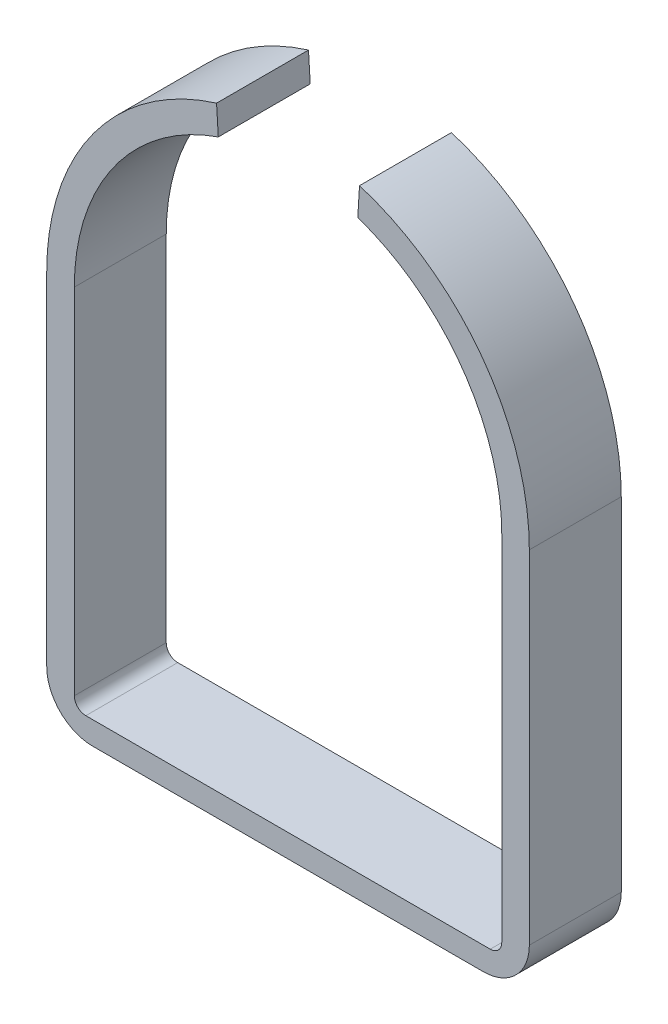
ISO-10303-21;
HEADER;
FILE_DESCRIPTION(('STEP AP214'),'2;1');
FILE_NAME('part.step','',(''),(''),'','','');
FILE_SCHEMA(('AUTOMOTIVE_DESIGN { 1 0 10303 214 1 1 1 1 }'));
ENDSEC;
DATA;
#1=APPLICATION_CONTEXT('core data for automotive mechanical design processes');
#2=APPLICATION_PROTOCOL_DEFINITION('international standard','automotive_design',2000,#1);
#3=PRODUCT_CONTEXT('',#1,'mechanical');
#4=PRODUCT('Part','Part','',(#3));
#5=PRODUCT_RELATED_PRODUCT_CATEGORY('part','',(#4));
#6=PRODUCT_DEFINITION_FORMATION('','',#4);
#7=PRODUCT_DEFINITION_CONTEXT('part definition',#1,'design');
#8=PRODUCT_DEFINITION('design','',#6,#7);
#9=PRODUCT_DEFINITION_SHAPE('','',#8);
#10=(LENGTH_UNIT() NAMED_UNIT(*) SI_UNIT(.MILLI.,.METRE.));
#11=(NAMED_UNIT(*) PLANE_ANGLE_UNIT() SI_UNIT($,.RADIAN.));
#12=(NAMED_UNIT(*) SI_UNIT($,.STERADIAN.) SOLID_ANGLE_UNIT());
#13=UNCERTAINTY_MEASURE_WITH_UNIT(LENGTH_MEASURE(1.E-05),#10,'distance_accuracy_value','');
#14=(GEOMETRIC_REPRESENTATION_CONTEXT(3) GLOBAL_UNCERTAINTY_ASSIGNED_CONTEXT((#13)) GLOBAL_UNIT_ASSIGNED_CONTEXT((#10,
#11,#12)) REPRESENTATION_CONTEXT('',''));
#15=CARTESIAN_POINT('',(0.,0.,0.));
#16=DIRECTION('',(0.,0.,1.));
#17=DIRECTION('',(1.,0.,0.));
#18=AXIS2_PLACEMENT_3D('',#15,#16,#17);
#19=CARTESIAN_POINT('',(0.,0.,56.8469714478884));
#20=DIRECTION('',(0.,0.,-1.));
#21=DIRECTION('',(-1.,0.,0.));
#22=AXIS2_PLACEMENT_3D('',#19,#20,#21);
#23=CYLINDRICAL_SURFACE('',#22,9.3);
#24=DIRECTION('',(0.,0.,-1.));
#25=VECTOR('',#24,1.);
#26=CARTESIAN_POINT('',(3.03467311666204,8.79094756411439,56.8469714478884));
#27=LINE('',#26,#25);
#28=CARTESIAN_POINT('',(3.03467311666204,8.79094756411439,1.5));
#29=VERTEX_POINT('',#28);
#30=CARTESIAN_POINT('',(3.03467311666204,8.79094756411439,5.5));
#31=VERTEX_POINT('',#30);
#32=EDGE_CURVE('E238',#29,#31,#27,.F.);
#33=ORIENTED_EDGE('',*,*,#32,.F.);
#34=CARTESIAN_POINT('',(0.,0.,1.5));
#35=DIRECTION('',(0.,0.,1.));
#36=DIRECTION('',(-1.,0.,0.));
#37=AXIS2_PLACEMENT_3D('',#34,#35,#36);
#38=CIRCLE('',#37,9.3);
#39=CARTESIAN_POINT('',(9.3,0.,1.5));
#40=VERTEX_POINT('',#39);
#41=EDGE_CURVE('E220',#40,#29,#38,.T.);
#42=ORIENTED_EDGE('',*,*,#41,.F.);
#43=DIRECTION('',(0.,0.,-1.));
#44=VECTOR('',#43,1.);
#45=CARTESIAN_POINT('',(9.3,0.,56.8469714478884));
#46=LINE('',#45,#44);
#47=CARTESIAN_POINT('',(9.3,0.,5.5));
#48=VERTEX_POINT('',#47);
#49=EDGE_CURVE('E307',#48,#40,#46,.T.);
#50=ORIENTED_EDGE('',*,*,#49,.F.);
#51=CARTESIAN_POINT('',(0.,0.,5.5));
#52=DIRECTION('',(0.,0.,1.));
#53=DIRECTION('',(1.,0.,0.));
#54=AXIS2_PLACEMENT_3D('',#51,#52,#53);
#55=CIRCLE('',#54,9.3);
#56=EDGE_CURVE('E255',#48,#31,#55,.T.);
#57=ORIENTED_EDGE('',*,*,#56,.T.);
#58=EDGE_LOOP('',(#33,#42,#50,#57));
#59=FACE_BOUND('',#58,.T.);
#60=ADVANCED_FACE('F48',(#59),#23,.F.);
#61=CARTESIAN_POINT('',(0.,0.,5.5));
#62=DIRECTION('',(0.,0.,1.));
#63=DIRECTION('',(1.,0.,0.));
#64=AXIS2_PLACEMENT_3D('',#61,#62,#63);
#65=PLANE('',#64);
#66=DIRECTION('',(0.,-1.,0.));
#67=VECTOR('',#66,1.);
#68=CARTESIAN_POINT('',(-10.5,0.,5.5));
#69=LINE('',#68,#67);
#70=CARTESIAN_POINT('',(-10.5,0.,5.5));
#71=VERTEX_POINT('',#70);
#72=CARTESIAN_POINT('',(-10.5,-14.900343897342,5.5));
#73=VERTEX_POINT('',#72);
#74=EDGE_CURVE('E180',#71,#73,#69,.T.);
#75=ORIENTED_EDGE('',*,*,#74,.T.);
#76=CARTESIAN_POINT('',(-8.5,-14.900343897342,5.5));
#77=DIRECTION('',(0.,0.,1.));
#78=DIRECTION('',(1.,0.,0.));
#79=AXIS2_PLACEMENT_3D('',#76,#77,#78);
#80=CIRCLE('',#79,2.);
#81=CARTESIAN_POINT('',(-8.5,-16.900343897342,5.5));
#82=VERTEX_POINT('',#81);
#83=EDGE_CURVE('E319',#73,#82,#80,.T.);
#84=ORIENTED_EDGE('',*,*,#83,.T.);
#85=DIRECTION('',(-1.,0.,0.));
#86=VECTOR('',#85,1.);
#87=CARTESIAN_POINT('',(-11.1726993556512,-16.900343897342,5.5));
#88=LINE('',#87,#86);
#89=CARTESIAN_POINT('',(8.5,-16.900343897342,5.5));
#90=VERTEX_POINT('',#89);
#91=EDGE_CURVE('E174',#90,#82,#88,.T.);
#92=ORIENTED_EDGE('',*,*,#91,.F.);
#93=CARTESIAN_POINT('',(8.5,-14.900343897342,5.5));
#94=DIRECTION('',(0.,0.,1.));
#95=DIRECTION('',(1.,0.,0.));
#96=AXIS2_PLACEMENT_3D('',#93,#94,#95);
#97=CIRCLE('',#96,2.);
#98=CARTESIAN_POINT('',(10.5,-14.900343897342,5.5));
#99=VERTEX_POINT('',#98);
#100=EDGE_CURVE('E316',#90,#99,#97,.T.);
#101=ORIENTED_EDGE('',*,*,#100,.T.);
#102=DIRECTION('',(0.,-1.,0.));
#103=VECTOR('',#102,1.);
#104=CARTESIAN_POINT('',(10.5,0.,5.5));
#105=LINE('',#104,#103);
#106=CARTESIAN_POINT('',(10.5,0.,5.5));
#107=VERTEX_POINT('',#106);
#108=EDGE_CURVE('E260',#107,#99,#105,.T.);
#109=ORIENTED_EDGE('',*,*,#108,.F.);
#110=CARTESIAN_POINT('',(0.,0.,5.5));
#111=DIRECTION('',(0.,0.,1.));
#112=DIRECTION('',(1.,0.,0.));
#113=AXIS2_PLACEMENT_3D('',#110,#111,#112);
#114=CIRCLE('',#113,10.5);
#115=CARTESIAN_POINT('',(3.11032664956738,10.0287520725657,5.5));
#116=VERTEX_POINT('',#115);
#117=EDGE_CURVE('E263',#116,#107,#114,.F.);
#118=ORIENTED_EDGE('',*,*,#117,.F.);
#119=DIRECTION('',(-0.0610052906976046,-0.998137442693591,0.));
#120=VECTOR('',#119,1.);
#121=CARTESIAN_POINT('',(2.48808370636675,-0.15206950796001,5.5));
#122=LINE('',#121,#120);
#123=EDGE_CURVE('E270',#116,#31,#122,.T.);
#124=ORIENTED_EDGE('',*,*,#123,.T.);
#125=ORIENTED_EDGE('',*,*,#56,.F.);
#126=DIRECTION('',(0.,1.,0.));
#127=VECTOR('',#126,1.);
#128=CARTESIAN_POINT('',(9.3,0.,5.5));
#129=LINE('',#128,#127);
#130=CARTESIAN_POINT('',(9.3,-15.4,5.5));
#131=VERTEX_POINT('',#130);
#132=EDGE_CURVE('E252',#131,#48,#129,.T.);
#133=ORIENTED_EDGE('',*,*,#132,.F.);
#134=CARTESIAN_POINT('',(8.8,-15.4,5.5));
#135=DIRECTION('',(0.,0.,1.));
#136=DIRECTION('',(1.,0.,0.));
#137=AXIS2_PLACEMENT_3D('',#134,#135,#136);
#138=CIRCLE('',#137,0.5);
#139=CARTESIAN_POINT('',(8.8,-15.9,5.5));
#140=VERTEX_POINT('',#139);
#141=EDGE_CURVE('E279',#131,#140,#138,.F.);
#142=ORIENTED_EDGE('',*,*,#141,.T.);
#143=DIRECTION('',(1.,0.,0.));
#144=VECTOR('',#143,1.);
#145=CARTESIAN_POINT('',(0.,-15.9,5.5));
#146=LINE('',#145,#144);
#147=CARTESIAN_POINT('',(-8.8,-15.9,5.5));
#148=VERTEX_POINT('',#147);
#149=EDGE_CURVE('E248',#148,#140,#146,.T.);
#150=ORIENTED_EDGE('',*,*,#149,.F.);
#151=CARTESIAN_POINT('',(-8.8,-15.4,5.5));
#152=DIRECTION('',(0.,0.,1.));
#153=DIRECTION('',(1.,0.,0.));
#154=AXIS2_PLACEMENT_3D('',#151,#152,#153);
#155=CIRCLE('',#154,0.5);
#156=CARTESIAN_POINT('',(-9.3,-15.4,5.5));
#157=VERTEX_POINT('',#156);
#158=EDGE_CURVE('E242',#148,#157,#155,.F.);
#159=ORIENTED_EDGE('',*,*,#158,.T.);
#160=DIRECTION('',(0.,-1.,0.));
#161=VECTOR('',#160,1.);
#162=CARTESIAN_POINT('',(-9.3,-15.9,5.5));
#163=LINE('',#162,#161);
#164=CARTESIAN_POINT('',(-9.3,0.,5.5));
#165=VERTEX_POINT('',#164);
#166=EDGE_CURVE('E243',#165,#157,#163,.T.);
#167=ORIENTED_EDGE('',*,*,#166,.F.);
#168=CARTESIAN_POINT('',(-3.03467311644218,8.79094756419029,5.5));
#169=VERTEX_POINT('',#168);
#170=EDGE_CURVE('E259',#169,#165,#55,.T.);
#171=ORIENTED_EDGE('',*,*,#170,.F.);
#172=DIRECTION('',(-0.0610052909139107,0.99813744268037,0.));
#173=VECTOR('',#172,1.);
#174=CARTESIAN_POINT('',(-2.48808370417207,-0.152069508367079,5.5));
#175=LINE('',#174,#173);
#176=CARTESIAN_POINT('',(-3.11032664961128,10.0287520725521,5.5));
#177=VERTEX_POINT('',#176);
#178=EDGE_CURVE('E273',#169,#177,#175,.T.);
#179=ORIENTED_EDGE('',*,*,#178,.T.);
#180=CARTESIAN_POINT('',(0.,0.,5.5));
#181=DIRECTION('',(0.,0.,1.));
#182=DIRECTION('',(1.,0.,0.));
#183=AXIS2_PLACEMENT_3D('',#180,#181,#182);
#184=CIRCLE('',#183,10.5);
#185=EDGE_CURVE('E267',#71,#177,#184,.F.);
#186=ORIENTED_EDGE('',*,*,#185,.F.);
#187=EDGE_LOOP('',(#75,#84,#92,#101,#109,#118,#124,#125,#133,#142,#150,#159,#167,#171,#179,#186));
#188=FACE_BOUND('',#187,.T.);
#189=ADVANCED_FACE('F340',(#188),#65,.T.);
#190=DIRECTION('',(0.,0.,-1.));
#191=VECTOR('',#190,1.);
#192=CARTESIAN_POINT('',(-3.03467311644218,8.79094756419029,56.8469714478884));
#193=LINE('',#192,#191);
#194=CARTESIAN_POINT('',(-3.03467311644218,8.79094756419029,1.5));
#195=VERTEX_POINT('',#194);
#196=EDGE_CURVE('E235',#169,#195,#193,.T.);
#197=ORIENTED_EDGE('',*,*,#196,.F.);
#198=ORIENTED_EDGE('',*,*,#170,.T.);
#199=DIRECTION('',(0.,0.,-1.));
#200=VECTOR('',#199,1.);
#201=CARTESIAN_POINT('',(-9.3,0.,56.8469714478884));
#202=LINE('',#201,#200);
#203=CARTESIAN_POINT('',(-9.3,0.,1.5));
#204=VERTEX_POINT('',#203);
#205=EDGE_CURVE('E185',#165,#204,#202,.T.);
#206=ORIENTED_EDGE('',*,*,#205,.T.);
#207=CARTESIAN_POINT('',(0.,0.,1.5));
#208=DIRECTION('',(0.,0.,1.));
#209=DIRECTION('',(-1.,0.,0.));
#210=AXIS2_PLACEMENT_3D('',#207,#208,#209);
#211=CIRCLE('',#210,9.3);
#212=EDGE_CURVE('E193',#195,#204,#211,.T.);
#213=ORIENTED_EDGE('',*,*,#212,.F.);
#214=EDGE_LOOP('',(#197,#198,#206,#213));
#215=FACE_BOUND('',#214,.T.);
#216=ADVANCED_FACE('F336',(#215),#23,.F.);
#217=CARTESIAN_POINT('',(-9.3,-15.9,56.8469714478884));
#218=DIRECTION('',(1.,0.,0.));
#219=DIRECTION('',(0.,0.,-1.));
#220=AXIS2_PLACEMENT_3D('',#217,#218,#219);
#221=PLANE('',#220);
#222=DIRECTION('',(0.,0.,-1.));
#223=VECTOR('',#222,1.);
#224=CARTESIAN_POINT('',(-9.3,-15.4,0.));
#225=LINE('',#224,#223);
#226=CARTESIAN_POINT('',(-9.3,-15.4,1.5));
#227=VERTEX_POINT('',#226);
#228=EDGE_CURVE('E247',#157,#227,#225,.T.);
#229=ORIENTED_EDGE('',*,*,#228,.T.);
#230=DIRECTION('',(0.,-1.,0.));
#231=VECTOR('',#230,1.);
#232=CARTESIAN_POINT('',(-9.3,0.,1.5));
#233=LINE('',#232,#231);
#234=EDGE_CURVE('E200',#204,#227,#233,.T.);
#235=ORIENTED_EDGE('',*,*,#234,.F.);
#236=ORIENTED_EDGE('',*,*,#205,.F.);
#237=ORIENTED_EDGE('',*,*,#166,.T.);
#238=EDGE_LOOP('',(#229,#235,#236,#237));
#239=FACE_BOUND('',#238,.T.);
#240=ADVANCED_FACE('F345',(#239),#221,.T.);
#241=CARTESIAN_POINT('',(0.,-15.9,56.8469714478884));
#242=DIRECTION('',(0.,1.,0.));
#243=DIRECTION('',(0.,0.,1.));
#244=AXIS2_PLACEMENT_3D('',#241,#242,#243);
#245=PLANE('',#244);
#246=DIRECTION('',(0.,0.,-1.));
#247=VECTOR('',#246,1.);
#248=CARTESIAN_POINT('',(8.8,-15.9,0.));
#249=LINE('',#248,#247);
#250=CARTESIAN_POINT('',(8.8,-15.9,1.5));
#251=VERTEX_POINT('',#250);
#252=EDGE_CURVE('E291',#140,#251,#249,.T.);
#253=ORIENTED_EDGE('',*,*,#252,.T.);
#254=DIRECTION('',(1.,0.,0.));
#255=VECTOR('',#254,1.);
#256=CARTESIAN_POINT('',(-8.8,-15.9,1.5));
#257=LINE('',#256,#255);
#258=CARTESIAN_POINT('',(-8.8,-15.9,1.5));
#259=VERTEX_POINT('',#258);
#260=EDGE_CURVE('E208',#259,#251,#257,.T.);
#261=ORIENTED_EDGE('',*,*,#260,.F.);
#262=DIRECTION('',(0.,0.,-1.));
#263=VECTOR('',#262,1.);
#264=CARTESIAN_POINT('',(-8.8,-15.9,6.02159565602451));
#265=LINE('',#264,#263);
#266=EDGE_CURVE('E294',#259,#148,#265,.F.);
#267=ORIENTED_EDGE('',*,*,#266,.T.);
#268=ORIENTED_EDGE('',*,*,#149,.T.);
#269=EDGE_LOOP('',(#253,#261,#267,#268));
#270=FACE_BOUND('',#269,.T.);
#271=ADVANCED_FACE('F351',(#270),#245,.T.);
#272=CARTESIAN_POINT('',(-8.8,-15.4,56.8469714478884));
#273=DIRECTION('',(0.,0.,1.));
#274=DIRECTION('',(1.,0.,0.));
#275=AXIS2_PLACEMENT_3D('',#272,#273,#274);
#276=CYLINDRICAL_SURFACE('',#275,0.5);
#277=ORIENTED_EDGE('',*,*,#266,.F.);
#278=CARTESIAN_POINT('',(-8.8,-15.4,1.5));
#279=DIRECTION('',(0.,0.,1.));
#280=DIRECTION('',(-1.,0.,0.));
#281=AXIS2_PLACEMENT_3D('',#278,#279,#280);
#282=CIRCLE('',#281,0.5);
#283=EDGE_CURVE('E204',#227,#259,#282,.T.);
#284=ORIENTED_EDGE('',*,*,#283,.F.);
#285=ORIENTED_EDGE('',*,*,#228,.F.);
#286=ORIENTED_EDGE('',*,*,#158,.F.);
#287=EDGE_LOOP('',(#277,#284,#285,#286));
#288=FACE_BOUND('',#287,.T.);
#289=ADVANCED_FACE('F349',(#288),#276,.F.);
#290=CARTESIAN_POINT('',(9.3,0.,56.8469714478884));
#291=DIRECTION('',(-1.,0.,0.));
#292=DIRECTION('',(0.,-1.,0.));
#293=AXIS2_PLACEMENT_3D('',#290,#291,#292);
#294=PLANE('',#293);
#295=ORIENTED_EDGE('',*,*,#49,.T.);
#296=DIRECTION('',(0.,1.,0.));
#297=VECTOR('',#296,1.);
#298=CARTESIAN_POINT('',(9.3,-15.4,1.5));
#299=LINE('',#298,#297);
#300=CARTESIAN_POINT('',(9.3,-15.4,1.5));
#301=VERTEX_POINT('',#300);
#302=EDGE_CURVE('E216',#301,#40,#299,.T.);
#303=ORIENTED_EDGE('',*,*,#302,.F.);
#304=DIRECTION('',(0.,0.,-1.));
#305=VECTOR('',#304,1.);
#306=CARTESIAN_POINT('',(9.3,-15.4,6.0215956560245));
#307=LINE('',#306,#305);
#308=EDGE_CURVE('E288',#301,#131,#307,.F.);
#309=ORIENTED_EDGE('',*,*,#308,.T.);
#310=ORIENTED_EDGE('',*,*,#132,.T.);
#311=EDGE_LOOP('',(#295,#303,#309,#310));
#312=FACE_BOUND('',#311,.T.);
#313=ADVANCED_FACE('F361',(#312),#294,.T.);
#314=CARTESIAN_POINT('',(8.8,-15.4,56.8469714478884));
#315=DIRECTION('',(0.,0.,1.));
#316=DIRECTION('',(1.,0.,0.));
#317=AXIS2_PLACEMENT_3D('',#314,#315,#316);
#318=CYLINDRICAL_SURFACE('',#317,0.5);
#319=ORIENTED_EDGE('',*,*,#308,.F.);
#320=CARTESIAN_POINT('',(8.8,-15.4,1.5));
#321=DIRECTION('',(0.,0.,1.));
#322=DIRECTION('',(-1.,0.,0.));
#323=AXIS2_PLACEMENT_3D('',#320,#321,#322);
#324=CIRCLE('',#323,0.5);
#325=EDGE_CURVE('E212',#251,#301,#324,.T.);
#326=ORIENTED_EDGE('',*,*,#325,.F.);
#327=ORIENTED_EDGE('',*,*,#252,.F.);
#328=ORIENTED_EDGE('',*,*,#141,.F.);
#329=EDGE_LOOP('',(#319,#326,#327,#328));
#330=FACE_BOUND('',#329,.T.);
#331=ADVANCED_FACE('F356',(#330),#318,.F.);
#332=CARTESIAN_POINT('',(2.48808370636675,-0.15206950796001,7.65));
#333=DIRECTION('',(0.998137442693591,-0.0610052906976046,0.));
#334=DIRECTION('',(0.0610052906976046,0.998137442693591,0.));
#335=AXIS2_PLACEMENT_3D('',#332,#333,#334);
#336=PLANE('',#335);
#337=DIRECTION('',(0.,0.,-1.));
#338=VECTOR('',#337,1.);
#339=CARTESIAN_POINT('',(3.11032664956738,10.0287520725657,7.65));
#340=LINE('',#339,#338);
#341=CARTESIAN_POINT('',(3.11032664956738,10.0287520725657,1.5));
#342=VERTEX_POINT('',#341);
#343=EDGE_CURVE('E300',#116,#342,#340,.T.);
#344=ORIENTED_EDGE('',*,*,#343,.T.);
#345=DIRECTION('',(0.0610052906976045,0.998137442693591,0.));
#346=VECTOR('',#345,1.);
#347=CARTESIAN_POINT('',(3.03467311666204,8.79094756411439,1.5));
#348=LINE('',#347,#346);
#349=EDGE_CURVE('E224',#29,#342,#348,.T.);
#350=ORIENTED_EDGE('',*,*,#349,.F.);
#351=ORIENTED_EDGE('',*,*,#32,.T.);
#352=ORIENTED_EDGE('',*,*,#123,.F.);
#353=EDGE_LOOP('',(#344,#350,#351,#352));
#354=FACE_BOUND('',#353,.T.);
#355=ADVANCED_FACE('F367',(#354),#336,.F.);
#356=CARTESIAN_POINT('',(0.,0.,7.65));
#357=DIRECTION('',(0.,0.,-1.));
#358=DIRECTION('',(-1.,0.,0.));
#359=AXIS2_PLACEMENT_3D('',#356,#357,#358);
#360=CYLINDRICAL_SURFACE('',#359,10.5);
#361=DIRECTION('',(0.,0.,-1.));
#362=VECTOR('',#361,1.);
#363=CARTESIAN_POINT('',(-3.11032664961128,10.0287520725521,7.65));
#364=LINE('',#363,#362);
#365=CARTESIAN_POINT('',(-3.11032664961128,10.0287520725521,1.5));
#366=VERTEX_POINT('',#365);
#367=EDGE_CURVE('E186',#177,#366,#364,.T.);
#368=ORIENTED_EDGE('',*,*,#367,.T.);
#369=CARTESIAN_POINT('',(0.,0.,1.5));
#370=DIRECTION('',(0.,0.,-1.));
#371=DIRECTION('',(-1.,0.,0.));
#372=AXIS2_PLACEMENT_3D('',#369,#370,#371);
#373=CIRCLE('',#372,10.5);
#374=CARTESIAN_POINT('',(-10.5,0.,1.5));
#375=VERTEX_POINT('',#374);
#376=EDGE_CURVE('E167',#375,#366,#373,.T.);
#377=ORIENTED_EDGE('',*,*,#376,.F.);
#378=DIRECTION('',(0.,0.,-1.));
#379=VECTOR('',#378,1.);
#380=CARTESIAN_POINT('',(-10.5,0.,7.65));
#381=LINE('',#380,#379);
#382=EDGE_CURVE('E177',#71,#375,#381,.T.);
#383=ORIENTED_EDGE('',*,*,#382,.F.);
#384=ORIENTED_EDGE('',*,*,#185,.T.);
#385=EDGE_LOOP('',(#368,#377,#383,#384));
#386=FACE_BOUND('',#385,.T.);
#387=ADVANCED_FACE('F188',(#386),#360,.T.);
#388=CARTESIAN_POINT('',(-10.5,0.,7.65));
#389=DIRECTION('',(1.,0.,0.));
#390=DIRECTION('',(0.,0.,-1.));
#391=AXIS2_PLACEMENT_3D('',#388,#389,#390);
#392=PLANE('',#391);
#393=DIRECTION('',(0.,1.,0.));
#394=VECTOR('',#393,1.);
#395=CARTESIAN_POINT('',(-10.5,-17.,1.5));
#396=LINE('',#395,#394);
#397=CARTESIAN_POINT('',(-10.5,-14.900343897342,1.5));
#398=VERTEX_POINT('',#397);
#399=EDGE_CURVE('E162',#398,#375,#396,.T.);
#400=ORIENTED_EDGE('',*,*,#399,.F.);
#401=DIRECTION('',(0.,0.,1.));
#402=VECTOR('',#401,1.);
#403=CARTESIAN_POINT('',(-10.5,-14.900343897342,7.65));
#404=LINE('',#403,#402);
#405=EDGE_CURVE('E313',#398,#73,#404,.T.);
#406=ORIENTED_EDGE('',*,*,#405,.T.);
#407=ORIENTED_EDGE('',*,*,#74,.F.);
#408=ORIENTED_EDGE('',*,*,#382,.T.);
#409=EDGE_LOOP('',(#400,#406,#407,#408));
#410=FACE_BOUND('',#409,.T.);
#411=ADVANCED_FACE('F178',(#410),#392,.F.);
#412=DIRECTION('',(0.,0.,-1.));
#413=VECTOR('',#412,1.);
#414=CARTESIAN_POINT('',(10.5,0.,7.65));
#415=LINE('',#414,#413);
#416=CARTESIAN_POINT('',(10.5,0.,1.5));
#417=VERTEX_POINT('',#416);
#418=EDGE_CURVE('E297',#107,#417,#415,.T.);
#419=ORIENTED_EDGE('',*,*,#418,.T.);
#420=CARTESIAN_POINT('',(0.,0.,1.5));
#421=DIRECTION('',(0.,0.,-1.));
#422=DIRECTION('',(-1.,0.,0.));
#423=AXIS2_PLACEMENT_3D('',#420,#421,#422);
#424=CIRCLE('',#423,10.5);
#425=EDGE_CURVE('E228',#342,#417,#424,.T.);
#426=ORIENTED_EDGE('',*,*,#425,.F.);
#427=ORIENTED_EDGE('',*,*,#343,.F.);
#428=ORIENTED_EDGE('',*,*,#117,.T.);
#429=EDGE_LOOP('',(#419,#426,#427,#428));
#430=FACE_BOUND('',#429,.T.);
#431=ADVANCED_FACE('F371',(#430),#360,.T.);
#432=CARTESIAN_POINT('',(10.5,0.,7.65));
#433=DIRECTION('',(1.,0.,0.));
#434=DIRECTION('',(0.,1.,0.));
#435=AXIS2_PLACEMENT_3D('',#432,#433,#434);
#436=PLANE('',#435);
#437=ORIENTED_EDGE('',*,*,#108,.T.);
#438=DIRECTION('',(0.,0.,1.));
#439=VECTOR('',#438,1.);
#440=CARTESIAN_POINT('',(10.5,-14.900343897342,1.5));
#441=LINE('',#440,#439);
#442=CARTESIAN_POINT('',(10.5,-14.900343897342,1.5));
#443=VERTEX_POINT('',#442);
#444=EDGE_CURVE('E11',#99,#443,#441,.F.);
#445=ORIENTED_EDGE('',*,*,#444,.T.);
#446=DIRECTION('',(0.,-1.,0.));
#447=VECTOR('',#446,1.);
#448=CARTESIAN_POINT('',(10.5,0.,1.5));
#449=LINE('',#448,#447);
#450=EDGE_CURVE('E232',#417,#443,#449,.T.);
#451=ORIENTED_EDGE('',*,*,#450,.F.);
#452=ORIENTED_EDGE('',*,*,#418,.F.);
#453=EDGE_LOOP('',(#437,#445,#451,#452));
#454=FACE_BOUND('',#453,.T.);
#455=ADVANCED_FACE('F373',(#454),#436,.T.);
#456=CARTESIAN_POINT('',(-2.48808370417207,-0.152069508367079,7.65));
#457=DIRECTION('',(-0.99813744268037,-0.0610052909139107,0.));
#458=DIRECTION('',(0.0610052909139107,-0.99813744268037,0.));
#459=AXIS2_PLACEMENT_3D('',#456,#457,#458);
#460=PLANE('',#459);
#461=ORIENTED_EDGE('',*,*,#178,.F.);
#462=ORIENTED_EDGE('',*,*,#196,.T.);
#463=DIRECTION('',(0.0610052909138892,-0.998137442680372,0.));
#464=VECTOR('',#463,1.);
#465=CARTESIAN_POINT('',(-3.11032664961128,10.0287520725521,1.5));
#466=LINE('',#465,#464);
#467=EDGE_CURVE('E190',#366,#195,#466,.T.);
#468=ORIENTED_EDGE('',*,*,#467,.F.);
#469=ORIENTED_EDGE('',*,*,#367,.F.);
#470=EDGE_LOOP('',(#461,#462,#468,#469));
#471=FACE_BOUND('',#470,.T.);
#472=ADVANCED_FACE('F398',(#471),#460,.F.);
#473=CARTESIAN_POINT('',(9.35000000018532,-17.0923044276493,1.5));
#474=DIRECTION('',(0.,0.,-1.));
#475=DIRECTION('',(-1.,0.,0.));
#476=AXIS2_PLACEMENT_3D('',#473,#474,#475);
#477=PLANE('',#476);
#478=DIRECTION('',(1.,0.,0.));
#479=VECTOR('',#478,1.);
#480=CARTESIAN_POINT('',(9.35000000018532,-16.900343897342,1.5));
#481=LINE('',#480,#479);
#482=CARTESIAN_POINT('',(-8.5,-16.900343897342,1.5));
#483=VERTEX_POINT('',#482);
#484=CARTESIAN_POINT('',(8.5,-16.900343897342,1.5));
#485=VERTEX_POINT('',#484);
#486=EDGE_CURVE('E310',#483,#485,#481,.T.);
#487=ORIENTED_EDGE('',*,*,#486,.F.);
#488=CARTESIAN_POINT('',(-8.5,-14.900343897342,1.5));
#489=DIRECTION('',(0.,0.,-1.));
#490=DIRECTION('',(-1.,0.,0.));
#491=AXIS2_PLACEMENT_3D('',#488,#489,#490);
#492=CIRCLE('',#491,2.);
#493=EDGE_CURVE('E57',#483,#398,#492,.T.);
#494=ORIENTED_EDGE('',*,*,#493,.T.);
#495=ORIENTED_EDGE('',*,*,#399,.T.);
#496=ORIENTED_EDGE('',*,*,#376,.T.);
#497=ORIENTED_EDGE('',*,*,#467,.T.);
#498=ORIENTED_EDGE('',*,*,#212,.T.);
#499=ORIENTED_EDGE('',*,*,#234,.T.);
#500=ORIENTED_EDGE('',*,*,#283,.T.);
#501=ORIENTED_EDGE('',*,*,#260,.T.);
#502=ORIENTED_EDGE('',*,*,#325,.T.);
#503=ORIENTED_EDGE('',*,*,#302,.T.);
#504=ORIENTED_EDGE('',*,*,#41,.T.);
#505=ORIENTED_EDGE('',*,*,#349,.T.);
#506=ORIENTED_EDGE('',*,*,#425,.T.);
#507=ORIENTED_EDGE('',*,*,#450,.T.);
#508=CARTESIAN_POINT('',(8.5,-14.900343897342,1.5));
#509=DIRECTION('',(0.,0.,-1.));
#510=DIRECTION('',(-1.,0.,0.));
#511=AXIS2_PLACEMENT_3D('',#508,#509,#510);
#512=CIRCLE('',#511,2.);
#513=EDGE_CURVE('E69',#443,#485,#512,.T.);
#514=ORIENTED_EDGE('',*,*,#513,.T.);
#515=EDGE_LOOP('',(#487,#494,#495,#496,#497,#498,#499,#500,#501,#502,#503,#504,#505,#506,#507,#514));
#516=FACE_BOUND('',#515,.T.);
#517=ADVANCED_FACE('F164',(#516),#477,.T.);
#518=CARTESIAN_POINT('',(-11.1726993556512,-16.900343897342,-4.5));
#519=DIRECTION('',(0.,1.,0.));
#520=DIRECTION('',(0.,0.,1.));
#521=AXIS2_PLACEMENT_3D('',#518,#519,#520);
#522=PLANE('',#521);
#523=ORIENTED_EDGE('',*,*,#91,.T.);
#524=DIRECTION('',(0.,0.,1.));
#525=VECTOR('',#524,1.);
#526=CARTESIAN_POINT('',(-8.5,-16.900343897342,-4.5));
#527=LINE('',#526,#525);
#528=EDGE_CURVE('E326',#82,#483,#527,.F.);
#529=ORIENTED_EDGE('',*,*,#528,.T.);
#530=ORIENTED_EDGE('',*,*,#486,.T.);
#531=DIRECTION('',(0.,0.,1.));
#532=VECTOR('',#531,1.);
#533=CARTESIAN_POINT('',(8.5,-16.900343897342,5.5));
#534=LINE('',#533,#532);
#535=EDGE_CURVE('E322',#485,#90,#534,.T.);
#536=ORIENTED_EDGE('',*,*,#535,.T.);
#537=EDGE_LOOP('',(#523,#529,#530,#536));
#538=FACE_BOUND('',#537,.T.);
#539=ADVANCED_FACE('F379',(#538),#522,.F.);
#540=CARTESIAN_POINT('',(-8.5,-14.900343897342,7.65));
#541=DIRECTION('',(0.,0.,1.));
#542=DIRECTION('',(1.,0.,0.));
#543=AXIS2_PLACEMENT_3D('',#540,#541,#542);
#544=CYLINDRICAL_SURFACE('',#543,2.);
#545=ORIENTED_EDGE('',*,*,#493,.F.);
#546=ORIENTED_EDGE('',*,*,#528,.F.);
#547=ORIENTED_EDGE('',*,*,#83,.F.);
#548=ORIENTED_EDGE('',*,*,#405,.F.);
#549=EDGE_LOOP('',(#545,#546,#547,#548));
#550=FACE_BOUND('',#549,.T.);
#551=ADVANCED_FACE('F383',(#550),#544,.T.);
#552=CARTESIAN_POINT('',(8.5,-14.900343897342,-4.5));
#553=DIRECTION('',(0.,0.,-1.));
#554=DIRECTION('',(-1.,0.,0.));
#555=AXIS2_PLACEMENT_3D('',#552,#553,#554);
#556=CYLINDRICAL_SURFACE('',#555,2.);
#557=ORIENTED_EDGE('',*,*,#513,.F.);
#558=ORIENTED_EDGE('',*,*,#444,.F.);
#559=ORIENTED_EDGE('',*,*,#100,.F.);
#560=ORIENTED_EDGE('',*,*,#535,.F.);
#561=EDGE_LOOP('',(#557,#558,#559,#560));
#562=FACE_BOUND('',#561,.T.);
#563=ADVANCED_FACE('F50',(#562),#556,.T.);
#564=CLOSED_SHELL('',(#60,#189,#216,#240,#271,#289,#313,#331,#355,#387,#411,#431,#455,#472,#517,
#539,#551,#563));
#565=MANIFOLD_SOLID_BREP('B2',#564);
#566=ADVANCED_BREP_SHAPE_REPRESENTATION('',(#18,#565),#14);
#567=SHAPE_DEFINITION_REPRESENTATION(#9,#566);
ENDSEC;
END-ISO-10303-21;
